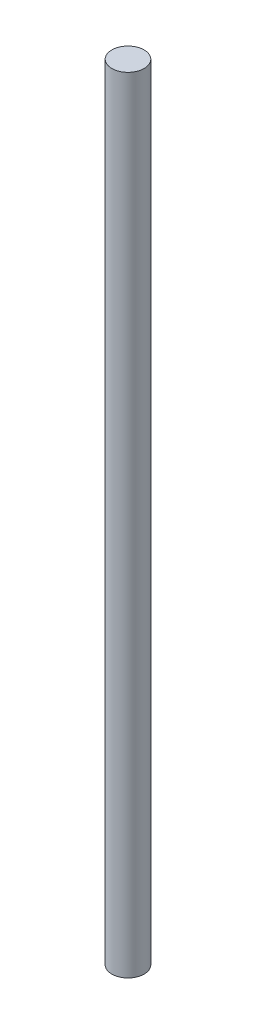
ISO-10303-21;
HEADER;
FILE_DESCRIPTION(('STEP AP214'),'2;1');
FILE_NAME('part.step','',(''),(''),'','','');
FILE_SCHEMA(('AUTOMOTIVE_DESIGN { 1 0 10303 214 1 1 1 1 }'));
ENDSEC;
DATA;
#1=APPLICATION_CONTEXT('core data for automotive mechanical design processes');
#2=APPLICATION_PROTOCOL_DEFINITION('international standard','automotive_design',2000,#1);
#3=PRODUCT_CONTEXT('',#1,'mechanical');
#4=PRODUCT('Part','Part','',(#3));
#5=PRODUCT_RELATED_PRODUCT_CATEGORY('part','',(#4));
#6=PRODUCT_DEFINITION_FORMATION('','',#4);
#7=PRODUCT_DEFINITION_CONTEXT('part definition',#1,'design');
#8=PRODUCT_DEFINITION('design','',#6,#7);
#9=PRODUCT_DEFINITION_SHAPE('','',#8);
#10=(LENGTH_UNIT() NAMED_UNIT(*) SI_UNIT(.MILLI.,.METRE.));
#11=(NAMED_UNIT(*) PLANE_ANGLE_UNIT() SI_UNIT($,.RADIAN.));
#12=(NAMED_UNIT(*) SI_UNIT($,.STERADIAN.) SOLID_ANGLE_UNIT());
#13=UNCERTAINTY_MEASURE_WITH_UNIT(LENGTH_MEASURE(1.E-05),#10,'distance_accuracy_value','');
#14=(GEOMETRIC_REPRESENTATION_CONTEXT(3) GLOBAL_UNCERTAINTY_ASSIGNED_CONTEXT((#13)) GLOBAL_UNIT_ASSIGNED_CONTEXT((#10,
#11,#12)) REPRESENTATION_CONTEXT('',''));
#15=CARTESIAN_POINT('',(0.,0.,0.));
#16=DIRECTION('',(0.,0.,1.));
#17=DIRECTION('',(1.,0.,0.));
#18=AXIS2_PLACEMENT_3D('',#15,#16,#17);
#19=CARTESIAN_POINT('',(0.,130.,0.));
#20=DIRECTION('',(0.,-1.,0.));
#21=DIRECTION('',(0.,0.,-1.));
#22=AXIS2_PLACEMENT_3D('',#19,#20,#21);
#23=CYLINDRICAL_SURFACE('',#22,2.675);
#24=CARTESIAN_POINT('',(0.,130.,0.));
#25=DIRECTION('',(0.,1.,0.));
#26=DIRECTION('',(0.,0.,1.));
#27=AXIS2_PLACEMENT_3D('',#24,#25,#26);
#28=CIRCLE('',#27,2.675);
#29=CARTESIAN_POINT('',(0.,130.,2.675));
#30=VERTEX_POINT('',#29);
#31=EDGE_CURVE('E10',#30,#30,#28,.T.);
#32=ORIENTED_EDGE('',*,*,#31,.F.);
#33=EDGE_LOOP('',(#32));
#34=FACE_BOUND('',#33,.T.);
#35=CARTESIAN_POINT('',(0.,0.,0.));
#36=DIRECTION('',(0.,1.,0.));
#37=DIRECTION('',(0.,0.,1.));
#38=AXIS2_PLACEMENT_3D('',#35,#36,#37);
#39=CIRCLE('',#38,2.675);
#40=CARTESIAN_POINT('',(0.,0.,2.675));
#41=VERTEX_POINT('',#40);
#42=EDGE_CURVE('E34',#41,#41,#39,.T.);
#43=ORIENTED_EDGE('',*,*,#42,.T.);
#44=EDGE_LOOP('',(#43));
#45=FACE_BOUND('',#44,.T.);
#46=ADVANCED_FACE('F31',(#34,#45),#23,.T.);
#47=CARTESIAN_POINT('',(0.,130.,0.));
#48=DIRECTION('',(0.,1.,0.));
#49=DIRECTION('',(0.,0.,1.));
#50=AXIS2_PLACEMENT_3D('',#47,#48,#49);
#51=PLANE('',#50);
#52=ORIENTED_EDGE('',*,*,#31,.T.);
#53=EDGE_LOOP('',(#52));
#54=FACE_BOUND('',#53,.T.);
#55=ADVANCED_FACE('F46',(#54),#51,.T.);
#56=CARTESIAN_POINT('',(0.,0.,0.));
#57=DIRECTION('',(0.,1.,0.));
#58=DIRECTION('',(0.,0.,1.));
#59=AXIS2_PLACEMENT_3D('',#56,#57,#58);
#60=PLANE('',#59);
#61=ORIENTED_EDGE('',*,*,#42,.F.);
#62=EDGE_LOOP('',(#61));
#63=FACE_BOUND('',#62,.T.);
#64=ADVANCED_FACE('F44',(#63),#60,.F.);
#65=CLOSED_SHELL('',(#46,#55,#64));
#66=MANIFOLD_SOLID_BREP('B2',#65);
#67=ADVANCED_BREP_SHAPE_REPRESENTATION('',(#18,#66),#14);
#68=SHAPE_DEFINITION_REPRESENTATION(#9,#67);
ENDSEC;
END-ISO-10303-21;
